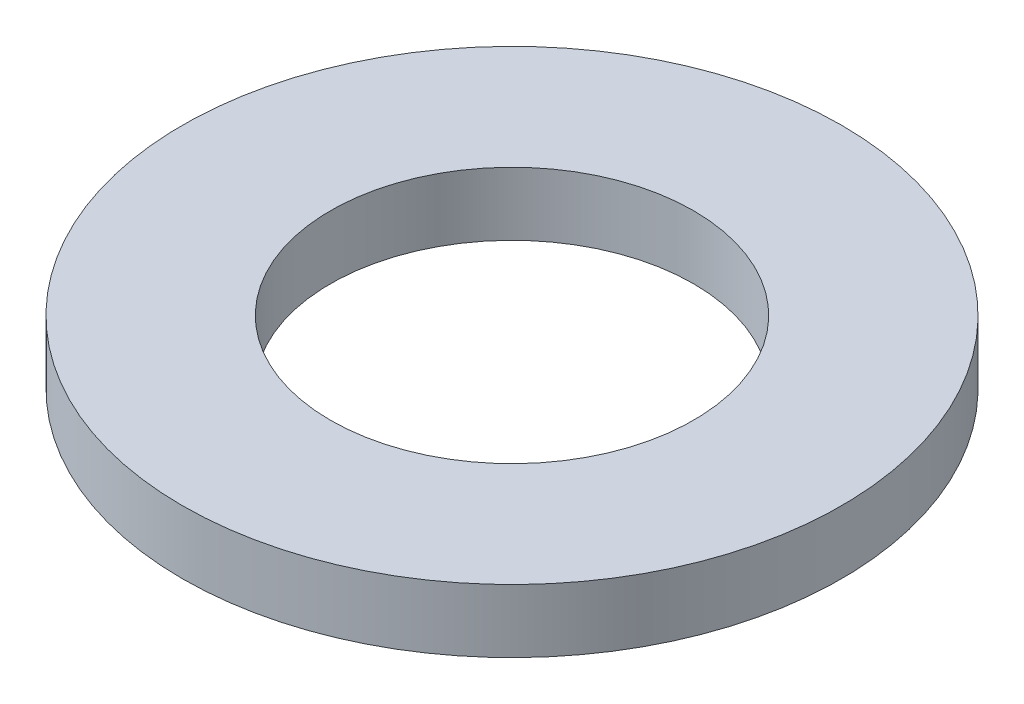
ISO-10303-21;
HEADER;
FILE_DESCRIPTION(('STEP AP214'),'2;1');
FILE_NAME('part.step','',(''),(''),'','','');
FILE_SCHEMA(('AUTOMOTIVE_DESIGN { 1 0 10303 214 1 1 1 1 }'));
ENDSEC;
DATA;
#1=APPLICATION_CONTEXT('core data for automotive mechanical design processes');
#2=APPLICATION_PROTOCOL_DEFINITION('international standard','automotive_design',2000,#1);
#3=PRODUCT_CONTEXT('',#1,'mechanical');
#4=PRODUCT('Part','Part','',(#3));
#5=PRODUCT_RELATED_PRODUCT_CATEGORY('part','',(#4));
#6=PRODUCT_DEFINITION_FORMATION('','',#4);
#7=PRODUCT_DEFINITION_CONTEXT('part definition',#1,'design');
#8=PRODUCT_DEFINITION('design','',#6,#7);
#9=PRODUCT_DEFINITION_SHAPE('','',#8);
#10=(LENGTH_UNIT() NAMED_UNIT(*) SI_UNIT(.MILLI.,.METRE.));
#11=(NAMED_UNIT(*) PLANE_ANGLE_UNIT() SI_UNIT($,.RADIAN.));
#12=(NAMED_UNIT(*) SI_UNIT($,.STERADIAN.) SOLID_ANGLE_UNIT());
#13=UNCERTAINTY_MEASURE_WITH_UNIT(LENGTH_MEASURE(1.E-05),#10,'distance_accuracy_value','');
#14=(GEOMETRIC_REPRESENTATION_CONTEXT(3) GLOBAL_UNCERTAINTY_ASSIGNED_CONTEXT((#13)) GLOBAL_UNIT_ASSIGNED_CONTEXT((#10,
#11,#12)) REPRESENTATION_CONTEXT('',''));
#15=CARTESIAN_POINT('',(0.,0.,0.));
#16=DIRECTION('',(0.,0.,1.));
#17=DIRECTION('',(1.,0.,0.));
#18=AXIS2_PLACEMENT_3D('',#15,#16,#17);
#19=CARTESIAN_POINT('',(0.,0.8636,0.));
#20=DIRECTION('',(0.,-1.,0.));
#21=DIRECTION('',(0.,0.,-1.));
#22=AXIS2_PLACEMENT_3D('',#19,#20,#21);
#23=CYLINDRICAL_SURFACE('',#22,4.4958);
#24=CARTESIAN_POINT('',(0.,0.8636,0.));
#25=DIRECTION('',(0.,1.,0.));
#26=DIRECTION('',(0.,0.,1.));
#27=AXIS2_PLACEMENT_3D('',#24,#25,#26);
#28=CIRCLE('',#27,4.4958);
#29=CARTESIAN_POINT('',(0.,0.8636,4.4958));
#30=VERTEX_POINT('',#29);
#31=EDGE_CURVE('E10',#30,#30,#28,.T.);
#32=ORIENTED_EDGE('',*,*,#31,.F.);
#33=EDGE_LOOP('',(#32));
#34=FACE_BOUND('',#33,.T.);
#35=CARTESIAN_POINT('',(0.,0.,0.));
#36=DIRECTION('',(0.,1.,0.));
#37=DIRECTION('',(0.,0.,1.));
#38=AXIS2_PLACEMENT_3D('',#35,#36,#37);
#39=CIRCLE('',#38,4.4958);
#40=CARTESIAN_POINT('',(0.,0.,4.4958));
#41=VERTEX_POINT('',#40);
#42=EDGE_CURVE('E33',#41,#41,#39,.T.);
#43=ORIENTED_EDGE('',*,*,#42,.T.);
#44=EDGE_LOOP('',(#43));
#45=FACE_BOUND('',#44,.T.);
#46=ADVANCED_FACE('F30',(#34,#45),#23,.T.);
#47=CARTESIAN_POINT('',(0.,0.8636,0.));
#48=DIRECTION('',(0.,1.,0.));
#49=DIRECTION('',(0.,0.,1.));
#50=AXIS2_PLACEMENT_3D('',#47,#48,#49);
#51=PLANE('',#50);
#52=CARTESIAN_POINT('',(0.,0.8636,0.));
#53=DIRECTION('',(0.,1.,0.));
#54=DIRECTION('',(0.,0.,1.));
#55=AXIS2_PLACEMENT_3D('',#52,#53,#54);
#56=CIRCLE('',#55,2.4765);
#57=CARTESIAN_POINT('',(0.,0.8636,2.4765));
#58=VERTEX_POINT('',#57);
#59=EDGE_CURVE('E42',#58,#58,#56,.T.);
#60=ORIENTED_EDGE('',*,*,#59,.F.);
#61=EDGE_LOOP('',(#60));
#62=FACE_BOUND('',#61,.T.);
#63=ORIENTED_EDGE('',*,*,#31,.T.);
#64=EDGE_LOOP('',(#63));
#65=FACE_BOUND('',#64,.T.);
#66=ADVANCED_FACE('F57',(#62,#65),#51,.T.);
#67=CARTESIAN_POINT('',(0.,0.,0.));
#68=DIRECTION('',(0.,1.,0.));
#69=DIRECTION('',(0.,0.,1.));
#70=AXIS2_PLACEMENT_3D('',#67,#68,#69);
#71=PLANE('',#70);
#72=CARTESIAN_POINT('',(0.,0.,0.));
#73=DIRECTION('',(0.,1.,0.));
#74=DIRECTION('',(0.,0.,1.));
#75=AXIS2_PLACEMENT_3D('',#72,#73,#74);
#76=CIRCLE('',#75,2.4765);
#77=CARTESIAN_POINT('',(0.,0.,2.4765));
#78=VERTEX_POINT('',#77);
#79=EDGE_CURVE('E40',#78,#78,#76,.T.);
#80=ORIENTED_EDGE('',*,*,#79,.T.);
#81=EDGE_LOOP('',(#80));
#82=FACE_BOUND('',#81,.T.);
#83=ORIENTED_EDGE('',*,*,#42,.F.);
#84=EDGE_LOOP('',(#83));
#85=FACE_BOUND('',#84,.T.);
#86=ADVANCED_FACE('F48',(#82,#85),#71,.F.);
#87=CARTESIAN_POINT('',(0.,0.,0.));
#88=DIRECTION('',(0.,1.,0.));
#89=DIRECTION('',(0.,0.,1.));
#90=AXIS2_PLACEMENT_3D('',#87,#88,#89);
#91=CYLINDRICAL_SURFACE('',#90,2.4765);
#92=ORIENTED_EDGE('',*,*,#79,.F.);
#93=EDGE_LOOP('',(#92));
#94=FACE_BOUND('',#93,.T.);
#95=ORIENTED_EDGE('',*,*,#59,.T.);
#96=EDGE_LOOP('',(#95));
#97=FACE_BOUND('',#96,.T.);
#98=ADVANCED_FACE('F51',(#94,#97),#91,.F.);
#99=CLOSED_SHELL('',(#46,#66,#86,#98));
#100=MANIFOLD_SOLID_BREP('B2',#99);
#101=ADVANCED_BREP_SHAPE_REPRESENTATION('',(#18,#100),#14);
#102=SHAPE_DEFINITION_REPRESENTATION(#9,#101);
ENDSEC;
END-ISO-10303-21;
